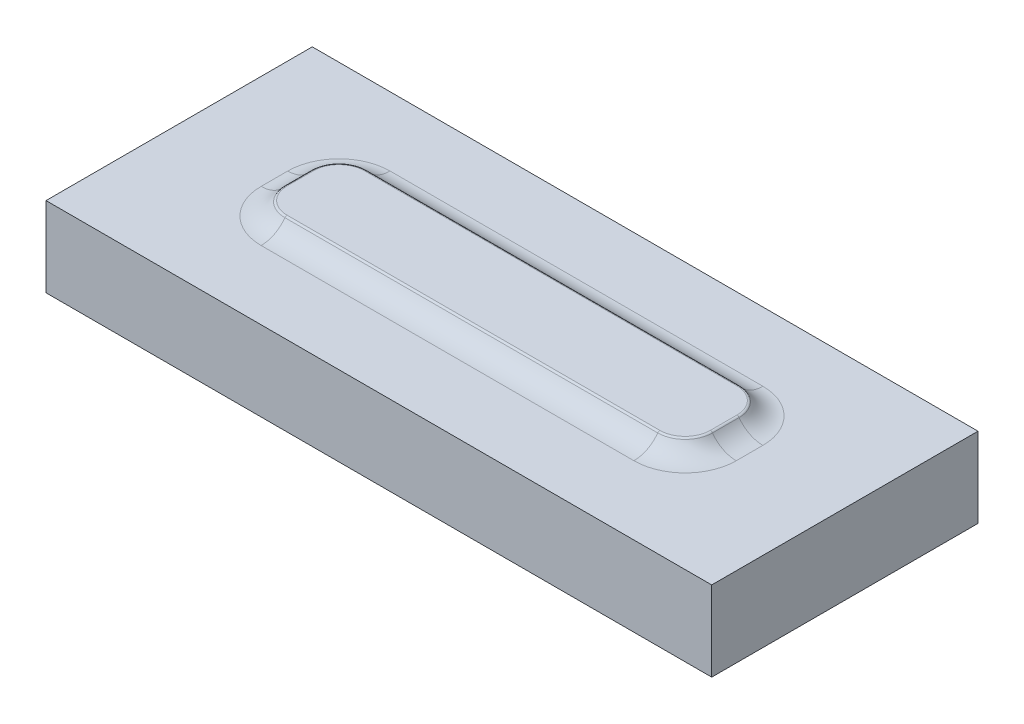
ISO-10303-21;
HEADER;
FILE_DESCRIPTION(('STEP AP214'),'2;1');
FILE_NAME('part.step','',(''),(''),'','','');
FILE_SCHEMA(('AUTOMOTIVE_DESIGN { 1 0 10303 214 1 1 1 1 }'));
ENDSEC;
DATA;
#1=APPLICATION_CONTEXT('core data for automotive mechanical design processes');
#2=APPLICATION_PROTOCOL_DEFINITION('international standard','automotive_design',2000,#1);
#3=PRODUCT_CONTEXT('',#1,'mechanical');
#4=PRODUCT('Part','Part','',(#3));
#5=PRODUCT_RELATED_PRODUCT_CATEGORY('part','',(#4));
#6=PRODUCT_DEFINITION_FORMATION('','',#4);
#7=PRODUCT_DEFINITION_CONTEXT('part definition',#1,'design');
#8=PRODUCT_DEFINITION('design','',#6,#7);
#9=PRODUCT_DEFINITION_SHAPE('','',#8);
#10=(LENGTH_UNIT() NAMED_UNIT(*) SI_UNIT(.MILLI.,.METRE.));
#11=(NAMED_UNIT(*) PLANE_ANGLE_UNIT() SI_UNIT($,.RADIAN.));
#12=(NAMED_UNIT(*) SI_UNIT($,.STERADIAN.) SOLID_ANGLE_UNIT());
#13=UNCERTAINTY_MEASURE_WITH_UNIT(LENGTH_MEASURE(1.E-05),#10,'distance_accuracy_value','');
#14=(GEOMETRIC_REPRESENTATION_CONTEXT(3) GLOBAL_UNCERTAINTY_ASSIGNED_CONTEXT((#13)) GLOBAL_UNIT_ASSIGNED_CONTEXT((#10,
#11,#12)) REPRESENTATION_CONTEXT('',''));
#15=CARTESIAN_POINT('',(0.,0.,0.));
#16=DIRECTION('',(0.,0.,1.));
#17=DIRECTION('',(1.,0.,0.));
#18=AXIS2_PLACEMENT_3D('',#15,#16,#17);
#19=CARTESIAN_POINT('',(0.,3.,0.));
#20=DIRECTION('',(0.,-1.,0.));
#21=DIRECTION('',(0.,0.,-1.));
#22=AXIS2_PLACEMENT_3D('',#19,#20,#21);
#23=PLANE('',#22);
#24=DIRECTION('',(1.,0.,0.));
#25=VECTOR('',#24,1.);
#26=CARTESIAN_POINT('',(0.,3.,2.42195444572929));
#27=LINE('',#26,#25);
#28=CARTESIAN_POINT('',(6.99999999999999,3.,2.42195444572929));
#29=VERTEX_POINT('',#28);
#30=CARTESIAN_POINT('',(-6.99999999999999,3.,2.42195444572929));
#31=VERTEX_POINT('',#30);
#32=EDGE_CURVE('E178',#29,#31,#27,.F.);
#33=ORIENTED_EDGE('',*,*,#32,.T.);
#34=CARTESIAN_POINT('',(-7.,3.,0.500000000000001));
#35=DIRECTION('',(0.,-1.,0.));
#36=DIRECTION('',(0.,0.,-1.));
#37=AXIS2_PLACEMENT_3D('',#34,#35,#36);
#38=CIRCLE('',#37,1.92195444572929);
#39=CARTESIAN_POINT('',(-8.92195444572929,3.,0.499999999999994));
#40=VERTEX_POINT('',#39);
#41=EDGE_CURVE('E200',#31,#40,#38,.T.);
#42=ORIENTED_EDGE('',*,*,#41,.T.);
#43=DIRECTION('',(0.,0.,1.));
#44=VECTOR('',#43,1.);
#45=CARTESIAN_POINT('',(-8.92195444572929,3.,0.));
#46=LINE('',#45,#44);
#47=CARTESIAN_POINT('',(-8.92195444572929,3.,-0.499999999999985));
#48=VERTEX_POINT('',#47);
#49=EDGE_CURVE('E197',#40,#48,#46,.F.);
#50=ORIENTED_EDGE('',*,*,#49,.T.);
#51=CARTESIAN_POINT('',(-7.,3.,-0.499999999999999));
#52=DIRECTION('',(0.,-1.,0.));
#53=DIRECTION('',(0.,0.,-1.));
#54=AXIS2_PLACEMENT_3D('',#51,#52,#53);
#55=CIRCLE('',#54,1.92195444572929);
#56=CARTESIAN_POINT('',(-6.99999999999999,3.,-2.42195444572929));
#57=VERTEX_POINT('',#56);
#58=EDGE_CURVE('E194',#48,#57,#55,.T.);
#59=ORIENTED_EDGE('',*,*,#58,.T.);
#60=DIRECTION('',(-1.,0.,0.));
#61=VECTOR('',#60,1.);
#62=CARTESIAN_POINT('',(0.,3.,-2.42195444572929));
#63=LINE('',#62,#61);
#64=CARTESIAN_POINT('',(6.99999999999999,3.,-2.42195444572929));
#65=VERTEX_POINT('',#64);
#66=EDGE_CURVE('E191',#57,#65,#63,.F.);
#67=ORIENTED_EDGE('',*,*,#66,.T.);
#68=CARTESIAN_POINT('',(7.,3.,-0.500000000000001));
#69=DIRECTION('',(0.,-1.,0.));
#70=DIRECTION('',(0.,0.,-1.));
#71=AXIS2_PLACEMENT_3D('',#68,#69,#70);
#72=CIRCLE('',#71,1.92195444572929);
#73=CARTESIAN_POINT('',(8.92195444572929,3.,-0.499999999999994));
#74=VERTEX_POINT('',#73);
#75=EDGE_CURVE('E189',#65,#74,#72,.T.);
#76=ORIENTED_EDGE('',*,*,#75,.T.);
#77=DIRECTION('',(0.,0.,-1.));
#78=VECTOR('',#77,1.);
#79=CARTESIAN_POINT('',(8.92195444572929,3.,0.));
#80=LINE('',#79,#78);
#81=CARTESIAN_POINT('',(8.92195444572929,3.,0.499999999999986));
#82=VERTEX_POINT('',#81);
#83=EDGE_CURVE('E187',#74,#82,#80,.F.);
#84=ORIENTED_EDGE('',*,*,#83,.T.);
#85=CARTESIAN_POINT('',(7.,3.,0.499999999999999));
#86=DIRECTION('',(0.,-1.,0.));
#87=DIRECTION('',(0.,0.,-1.));
#88=AXIS2_PLACEMENT_3D('',#85,#86,#87);
#89=CIRCLE('',#88,1.92195444572929);
#90=EDGE_CURVE('E180',#82,#29,#89,.T.);
#91=ORIENTED_EDGE('',*,*,#90,.T.);
#92=EDGE_LOOP('',(#33,#42,#50,#59,#67,#76,#84,#91));
#93=FACE_BOUND('',#92,.T.);
#94=DIRECTION('',(0.,0.,1.));
#95=VECTOR('',#94,1.);
#96=CARTESIAN_POINT('',(-12.5,3.,-5.));
#97=LINE('',#96,#95);
#98=CARTESIAN_POINT('',(-12.5,3.,-5.));
#99=VERTEX_POINT('',#98);
#100=CARTESIAN_POINT('',(-12.5,3.,5.));
#101=VERTEX_POINT('',#100);
#102=EDGE_CURVE('E165',#99,#101,#97,.T.);
#103=ORIENTED_EDGE('',*,*,#102,.T.);
#104=DIRECTION('',(1.,0.,0.));
#105=VECTOR('',#104,1.);
#106=CARTESIAN_POINT('',(12.5,3.,5.));
#107=LINE('',#106,#105);
#108=CARTESIAN_POINT('',(12.5,3.,5.));
#109=VERTEX_POINT('',#108);
#110=EDGE_CURVE('E154',#101,#109,#107,.T.);
#111=ORIENTED_EDGE('',*,*,#110,.T.);
#112=DIRECTION('',(0.,0.,-1.));
#113=VECTOR('',#112,1.);
#114=CARTESIAN_POINT('',(12.5,3.,-5.));
#115=LINE('',#114,#113);
#116=CARTESIAN_POINT('',(12.5,3.,-5.));
#117=VERTEX_POINT('',#116);
#118=EDGE_CURVE('E164',#109,#117,#115,.T.);
#119=ORIENTED_EDGE('',*,*,#118,.T.);
#120=DIRECTION('',(-1.,0.,0.));
#121=VECTOR('',#120,1.);
#122=CARTESIAN_POINT('',(12.5,3.,-5.));
#123=LINE('',#122,#121);
#124=EDGE_CURVE('E169',#117,#99,#123,.T.);
#125=ORIENTED_EDGE('',*,*,#124,.T.);
#126=EDGE_LOOP('',(#103,#111,#119,#125));
#127=FACE_BOUND('',#126,.T.);
#128=ADVANCED_FACE('F38',(#93,#127),#23,.F.);
#129=CARTESIAN_POINT('',(-12.5,3.,-5.));
#130=DIRECTION('',(1.,0.,0.));
#131=DIRECTION('',(0.,0.,-1.));
#132=AXIS2_PLACEMENT_3D('',#129,#130,#131);
#133=PLANE('',#132);
#134=DIRECTION('',(0.,0.,1.));
#135=VECTOR('',#134,1.);
#136=CARTESIAN_POINT('',(-12.5,0.,-5.));
#137=LINE('',#136,#135);
#138=CARTESIAN_POINT('',(-12.5,0.,-5.));
#139=VERTEX_POINT('',#138);
#140=CARTESIAN_POINT('',(-12.5,0.,5.));
#141=VERTEX_POINT('',#140);
#142=EDGE_CURVE('E177',#139,#141,#137,.T.);
#143=ORIENTED_EDGE('',*,*,#142,.T.);
#144=DIRECTION('',(0.,-1.,0.));
#145=VECTOR('',#144,1.);
#146=CARTESIAN_POINT('',(-12.5,3.,5.));
#147=LINE('',#146,#145);
#148=EDGE_CURVE('E158',#101,#141,#147,.T.);
#149=ORIENTED_EDGE('',*,*,#148,.F.);
#150=ORIENTED_EDGE('',*,*,#102,.F.);
#151=DIRECTION('',(0.,-1.,0.));
#152=VECTOR('',#151,1.);
#153=CARTESIAN_POINT('',(-12.5,3.,-5.));
#154=LINE('',#153,#152);
#155=EDGE_CURVE('E577',#99,#139,#154,.T.);
#156=ORIENTED_EDGE('',*,*,#155,.T.);
#157=EDGE_LOOP('',(#143,#149,#150,#156));
#158=FACE_BOUND('',#157,.T.);
#159=ADVANCED_FACE('F175',(#158),#133,.F.);
#160=CARTESIAN_POINT('',(12.5,3.,5.));
#161=DIRECTION('',(0.,0.,-1.));
#162=DIRECTION('',(-1.,0.,0.));
#163=AXIS2_PLACEMENT_3D('',#160,#161,#162);
#164=PLANE('',#163);
#165=DIRECTION('',(1.,0.,0.));
#166=VECTOR('',#165,1.);
#167=CARTESIAN_POINT('',(12.5,0.,5.));
#168=LINE('',#167,#166);
#169=CARTESIAN_POINT('',(12.5,0.,5.));
#170=VERTEX_POINT('',#169);
#171=EDGE_CURVE('E575',#141,#170,#168,.T.);
#172=ORIENTED_EDGE('',*,*,#171,.T.);
#173=DIRECTION('',(0.,-1.,0.));
#174=VECTOR('',#173,1.);
#175=CARTESIAN_POINT('',(12.5,3.,5.));
#176=LINE('',#175,#174);
#177=EDGE_CURVE('E161',#109,#170,#176,.T.);
#178=ORIENTED_EDGE('',*,*,#177,.F.);
#179=ORIENTED_EDGE('',*,*,#110,.F.);
#180=ORIENTED_EDGE('',*,*,#148,.T.);
#181=EDGE_LOOP('',(#172,#178,#179,#180));
#182=FACE_BOUND('',#181,.T.);
#183=ADVANCED_FACE('F156',(#182),#164,.F.);
#184=CARTESIAN_POINT('',(12.5,3.,-5.));
#185=DIRECTION('',(-1.,0.,0.));
#186=DIRECTION('',(0.,0.,1.));
#187=AXIS2_PLACEMENT_3D('',#184,#185,#186);
#188=PLANE('',#187);
#189=DIRECTION('',(0.,0.,-1.));
#190=VECTOR('',#189,1.);
#191=CARTESIAN_POINT('',(12.5,0.,-5.));
#192=LINE('',#191,#190);
#193=CARTESIAN_POINT('',(12.5,0.,-5.));
#194=VERTEX_POINT('',#193);
#195=EDGE_CURVE('E572',#170,#194,#192,.T.);
#196=ORIENTED_EDGE('',*,*,#195,.T.);
#197=DIRECTION('',(0.,-1.,0.));
#198=VECTOR('',#197,1.);
#199=CARTESIAN_POINT('',(12.5,3.,-5.));
#200=LINE('',#199,#198);
#201=EDGE_CURVE('E182',#117,#194,#200,.T.);
#202=ORIENTED_EDGE('',*,*,#201,.F.);
#203=ORIENTED_EDGE('',*,*,#118,.F.);
#204=ORIENTED_EDGE('',*,*,#177,.T.);
#205=EDGE_LOOP('',(#196,#202,#203,#204));
#206=FACE_BOUND('',#205,.T.);
#207=ADVANCED_FACE('F354',(#206),#188,.F.);
#208=CARTESIAN_POINT('',(12.5,3.,-5.));
#209=DIRECTION('',(0.,0.,1.));
#210=DIRECTION('',(1.,0.,0.));
#211=AXIS2_PLACEMENT_3D('',#208,#209,#210);
#212=PLANE('',#211);
#213=DIRECTION('',(-1.,0.,0.));
#214=VECTOR('',#213,1.);
#215=CARTESIAN_POINT('',(12.5,0.,-5.));
#216=LINE('',#215,#214);
#217=EDGE_CURVE('E173',#194,#139,#216,.T.);
#218=ORIENTED_EDGE('',*,*,#217,.T.);
#219=ORIENTED_EDGE('',*,*,#155,.F.);
#220=ORIENTED_EDGE('',*,*,#124,.F.);
#221=ORIENTED_EDGE('',*,*,#201,.T.);
#222=EDGE_LOOP('',(#218,#219,#220,#221));
#223=FACE_BOUND('',#222,.T.);
#224=ADVANCED_FACE('F350',(#223),#212,.F.);
#225=CARTESIAN_POINT('',(0.,0.,0.));
#226=DIRECTION('',(0.,-1.,0.));
#227=DIRECTION('',(0.,0.,-1.));
#228=AXIS2_PLACEMENT_3D('',#225,#226,#227);
#229=PLANE('',#228);
#230=ORIENTED_EDGE('',*,*,#142,.F.);
#231=ORIENTED_EDGE('',*,*,#217,.F.);
#232=ORIENTED_EDGE('',*,*,#195,.F.);
#233=ORIENTED_EDGE('',*,*,#171,.F.);
#234=EDGE_LOOP('',(#230,#231,#232,#233));
#235=FACE_BOUND('',#234,.T.);
#236=ADVANCED_FACE('F347',(#235),#229,.T.);
#237=CARTESIAN_POINT('',(-7.,3.5,0.500000000000001));
#238=DIRECTION('',(0.,1.,0.));
#239=DIRECTION('',(0.,0.,1.));
#240=AXIS2_PLACEMENT_3D('',#237,#238,#239);
#241=PLANE('',#240);
#242=DIRECTION('',(0.,0.,-1.));
#243=VECTOR('',#242,1.);
#244=CARTESIAN_POINT('',(-7.94727501124839,3.5,0.499999999999994));
#245=LINE('',#244,#243);
#246=CARTESIAN_POINT('',(-7.94727501124839,3.5,-0.499999999999991));
#247=VERTEX_POINT('',#246);
#248=CARTESIAN_POINT('',(-7.94727501124839,3.5,0.499999999999995));
#249=VERTEX_POINT('',#248);
#250=EDGE_CURVE('E232',#247,#249,#245,.F.);
#251=ORIENTED_EDGE('',*,*,#250,.T.);
#252=CARTESIAN_POINT('',(-7.,3.5,0.500000000000001));
#253=DIRECTION('',(0.,1.,0.));
#254=DIRECTION('',(0.,0.,1.));
#255=AXIS2_PLACEMENT_3D('',#252,#253,#254);
#256=CIRCLE('',#255,0.947275011248392);
#257=CARTESIAN_POINT('',(-6.99999999999999,3.5,1.44727501124839));
#258=VERTEX_POINT('',#257);
#259=EDGE_CURVE('E234',#249,#258,#256,.T.);
#260=ORIENTED_EDGE('',*,*,#259,.T.);
#261=DIRECTION('',(-1.,0.,0.));
#262=VECTOR('',#261,1.);
#263=CARTESIAN_POINT('',(6.99999999999999,3.5,1.44727501124839));
#264=LINE('',#263,#262);
#265=CARTESIAN_POINT('',(6.99999999999999,3.5,1.44727501124839));
#266=VERTEX_POINT('',#265);
#267=EDGE_CURVE('E203',#258,#266,#264,.F.);
#268=ORIENTED_EDGE('',*,*,#267,.T.);
#269=CARTESIAN_POINT('',(7.,3.5,0.499999999999999));
#270=DIRECTION('',(0.,1.,0.));
#271=DIRECTION('',(0.,0.,1.));
#272=AXIS2_PLACEMENT_3D('',#269,#270,#271);
#273=CIRCLE('',#272,0.947275011248392);
#274=CARTESIAN_POINT('',(7.94727501124839,3.5,0.499999999999992));
#275=VERTEX_POINT('',#274);
#276=EDGE_CURVE('E222',#266,#275,#273,.T.);
#277=ORIENTED_EDGE('',*,*,#276,.T.);
#278=DIRECTION('',(0.,0.,1.));
#279=VECTOR('',#278,1.);
#280=CARTESIAN_POINT('',(7.94727501124839,3.5,-0.499999999999994));
#281=LINE('',#280,#279);
#282=CARTESIAN_POINT('',(7.94727501124839,3.5,-0.499999999999994));
#283=VERTEX_POINT('',#282);
#284=EDGE_CURVE('E224',#275,#283,#281,.F.);
#285=ORIENTED_EDGE('',*,*,#284,.T.);
#286=CARTESIAN_POINT('',(7.,3.5,-0.500000000000001));
#287=DIRECTION('',(0.,1.,0.));
#288=DIRECTION('',(0.,0.,1.));
#289=AXIS2_PLACEMENT_3D('',#286,#287,#288);
#290=CIRCLE('',#289,0.947275011248392);
#291=CARTESIAN_POINT('',(6.99999999999999,3.5,-1.44727501124839));
#292=VERTEX_POINT('',#291);
#293=EDGE_CURVE('E226',#283,#292,#290,.T.);
#294=ORIENTED_EDGE('',*,*,#293,.T.);
#295=DIRECTION('',(1.,0.,0.));
#296=VECTOR('',#295,1.);
#297=CARTESIAN_POINT('',(-6.99999999999999,3.5,-1.44727501124839));
#298=LINE('',#297,#296);
#299=CARTESIAN_POINT('',(-6.99999999999999,3.5,-1.44727501124839));
#300=VERTEX_POINT('',#299);
#301=EDGE_CURVE('E228',#292,#300,#298,.F.);
#302=ORIENTED_EDGE('',*,*,#301,.T.);
#303=CARTESIAN_POINT('',(-7.,3.5,-0.499999999999999));
#304=DIRECTION('',(0.,1.,0.));
#305=DIRECTION('',(0.,0.,1.));
#306=AXIS2_PLACEMENT_3D('',#303,#304,#305);
#307=CIRCLE('',#306,0.947275011248392);
#308=EDGE_CURVE('E230',#300,#247,#307,.T.);
#309=ORIENTED_EDGE('',*,*,#308,.T.);
#310=EDGE_LOOP('',(#251,#260,#268,#277,#285,#294,#302,#309));
#311=FACE_BOUND('',#310,.T.);
#312=ADVANCED_FACE('F309',(#311),#241,.T.);
#313=CARTESIAN_POINT('',(7.,4.1,-0.500000000000001));
#314=DIRECTION('',(0.,-1.,0.));
#315=DIRECTION('',(0.,0.,-1.));
#316=AXIS2_PLACEMENT_3D('',#313,#314,#315);
#317=TOROIDAL_SURFACE('',#316,1.92195444572929,1.1);
#318=CARTESIAN_POINT('',(6.99999999999999,4.1,-2.42195444573013));
#319=DIRECTION('',(1.,0.,0.));
#320=DIRECTION('',(0.,0.,-1.));
#321=AXIS2_PLACEMENT_3D('',#318,#319,#320);
#322=CIRCLE('',#321,1.1);
#323=CARTESIAN_POINT('',(6.99999999999999,3.45833333333373,-1.52849829745569));
#324=VERTEX_POINT('',#323);
#325=EDGE_CURVE('E219',#324,#65,#322,.T.);
#326=ORIENTED_EDGE('',*,*,#325,.F.);
#327=CARTESIAN_POINT('',(7.,3.45833333333333,-0.500000000000001));
#328=DIRECTION('',(0.,1.,0.));
#329=DIRECTION('',(0.,0.,1.));
#330=AXIS2_PLACEMENT_3D('',#327,#328,#329);
#331=CIRCLE('',#330,1.02849829745513);
#332=CARTESIAN_POINT('',(8.02849829745513,3.45833333333333,-0.499999999999993));
#333=VERTEX_POINT('',#332);
#334=EDGE_CURVE('E246',#324,#333,#331,.F.);
#335=ORIENTED_EDGE('',*,*,#334,.T.);
#336=CARTESIAN_POINT('',(8.92195444572929,4.1,-0.499999999999987));
#337=DIRECTION('',(0.,0.,-1.));
#338=DIRECTION('',(-1.,0.,0.));
#339=AXIS2_PLACEMENT_3D('',#336,#337,#338);
#340=CIRCLE('',#339,1.1);
#341=EDGE_CURVE('E217',#74,#333,#340,.T.);
#342=ORIENTED_EDGE('',*,*,#341,.F.);
#343=ORIENTED_EDGE('',*,*,#75,.F.);
#344=EDGE_LOOP('',(#326,#335,#342,#343));
#345=FACE_BOUND('',#344,.T.);
#346=ADVANCED_FACE('F283',(#345),#317,.F.);
#347=CARTESIAN_POINT('',(6.99999999999999,4.1,-2.42195444572929));
#348=DIRECTION('',(-1.,0.,0.));
#349=DIRECTION('',(0.,0.,1.));
#350=AXIS2_PLACEMENT_3D('',#347,#348,#349);
#351=CYLINDRICAL_SURFACE('',#350,1.1);
#352=CARTESIAN_POINT('',(-6.99999999999999,4.1,-2.42195444573012));
#353=DIRECTION('',(1.,0.,0.));
#354=DIRECTION('',(0.,0.,-1.));
#355=AXIS2_PLACEMENT_3D('',#352,#353,#354);
#356=CIRCLE('',#355,1.1);
#357=CARTESIAN_POINT('',(-6.99999999999999,3.45833333333373,-1.52849829745568));
#358=VERTEX_POINT('',#357);
#359=EDGE_CURVE('E215',#358,#57,#356,.T.);
#360=ORIENTED_EDGE('',*,*,#359,.F.);
#361=DIRECTION('',(-1.,0.,0.));
#362=VECTOR('',#361,1.);
#363=CARTESIAN_POINT('',(6.99999999999999,3.45833333333333,-1.52849829745513));
#364=LINE('',#363,#362);
#365=EDGE_CURVE('E244',#358,#324,#364,.F.);
#366=ORIENTED_EDGE('',*,*,#365,.T.);
#367=ORIENTED_EDGE('',*,*,#325,.T.);
#368=ORIENTED_EDGE('',*,*,#66,.F.);
#369=EDGE_LOOP('',(#360,#366,#367,#368));
#370=FACE_BOUND('',#369,.T.);
#371=ADVANCED_FACE('F293',(#370),#351,.F.);
#372=CARTESIAN_POINT('',(8.92195444572929,4.1,-0.499999999999994));
#373=DIRECTION('',(0.,0.,-1.));
#374=DIRECTION('',(-1.,0.,0.));
#375=AXIS2_PLACEMENT_3D('',#372,#373,#374);
#376=CYLINDRICAL_SURFACE('',#375,1.1);
#377=ORIENTED_EDGE('',*,*,#341,.T.);
#378=DIRECTION('',(0.,0.,-1.));
#379=VECTOR('',#378,1.);
#380=CARTESIAN_POINT('',(8.02849829745513,3.45833333333333,-0.499999999999994));
#381=LINE('',#380,#379);
#382=CARTESIAN_POINT('',(8.02849829745513,3.45833333333333,0.499999999999992));
#383=VERTEX_POINT('',#382);
#384=EDGE_CURVE('E62',#333,#383,#381,.F.);
#385=ORIENTED_EDGE('',*,*,#384,.T.);
#386=CARTESIAN_POINT('',(8.92195444572929,4.1,0.499999999999992));
#387=DIRECTION('',(0.,0.,-1.));
#388=DIRECTION('',(-1.,0.,0.));
#389=AXIS2_PLACEMENT_3D('',#386,#387,#388);
#390=CIRCLE('',#389,1.1);
#391=EDGE_CURVE('E213',#82,#383,#390,.T.);
#392=ORIENTED_EDGE('',*,*,#391,.F.);
#393=ORIENTED_EDGE('',*,*,#83,.F.);
#394=EDGE_LOOP('',(#377,#385,#392,#393));
#395=FACE_BOUND('',#394,.T.);
#396=ADVANCED_FACE('F286',(#395),#376,.F.);
#397=CARTESIAN_POINT('',(-7.,4.1,-0.499999999999999));
#398=DIRECTION('',(0.,-1.,0.));
#399=DIRECTION('',(0.,0.,-1.));
#400=AXIS2_PLACEMENT_3D('',#397,#398,#399);
#401=TOROIDAL_SURFACE('',#400,1.92195444572929,1.1);
#402=CARTESIAN_POINT('',(-8.92195444573013,4.1,-0.499999999999985));
#403=DIRECTION('',(0.,0.,-1.));
#404=DIRECTION('',(-1.,0.,0.));
#405=AXIS2_PLACEMENT_3D('',#402,#403,#404);
#406=CIRCLE('',#405,1.1);
#407=CARTESIAN_POINT('',(-8.02849829745569,3.45833333333373,-0.499999999999991));
#408=VERTEX_POINT('',#407);
#409=EDGE_CURVE('E211',#408,#48,#406,.T.);
#410=ORIENTED_EDGE('',*,*,#409,.F.);
#411=CARTESIAN_POINT('',(-7.,3.45833333333333,-0.499999999999999));
#412=DIRECTION('',(0.,1.,0.));
#413=DIRECTION('',(0.,0.,1.));
#414=AXIS2_PLACEMENT_3D('',#411,#412,#413);
#415=CIRCLE('',#414,1.02849829745513);
#416=EDGE_CURVE('E242',#408,#358,#415,.F.);
#417=ORIENTED_EDGE('',*,*,#416,.T.);
#418=ORIENTED_EDGE('',*,*,#359,.T.);
#419=ORIENTED_EDGE('',*,*,#58,.F.);
#420=EDGE_LOOP('',(#410,#417,#418,#419));
#421=FACE_BOUND('',#420,.T.);
#422=ADVANCED_FACE('F296',(#421),#401,.F.);
#423=CARTESIAN_POINT('',(7.,4.1,0.499999999999999));
#424=DIRECTION('',(0.,-1.,0.));
#425=DIRECTION('',(0.,0.,-1.));
#426=AXIS2_PLACEMENT_3D('',#423,#424,#425);
#427=TOROIDAL_SURFACE('',#426,1.92195444572929,1.1);
#428=ORIENTED_EDGE('',*,*,#391,.T.);
#429=CARTESIAN_POINT('',(7.,3.45833333333333,0.499999999999999));
#430=DIRECTION('',(0.,1.,0.));
#431=DIRECTION('',(0.,0.,1.));
#432=AXIS2_PLACEMENT_3D('',#429,#430,#431);
#433=CIRCLE('',#432,1.02849829745513);
#434=CARTESIAN_POINT('',(6.99999999999999,3.45833333333333,1.52849829745513));
#435=VERTEX_POINT('',#434);
#436=EDGE_CURVE('E47',#383,#435,#433,.F.);
#437=ORIENTED_EDGE('',*,*,#436,.T.);
#438=CARTESIAN_POINT('',(6.99999999999999,4.1,2.42195444572929));
#439=DIRECTION('',(1.,0.,0.));
#440=DIRECTION('',(0.,0.,-1.));
#441=AXIS2_PLACEMENT_3D('',#438,#439,#440);
#442=CIRCLE('',#441,1.1);
#443=EDGE_CURVE('E209',#29,#435,#442,.T.);
#444=ORIENTED_EDGE('',*,*,#443,.F.);
#445=ORIENTED_EDGE('',*,*,#90,.F.);
#446=EDGE_LOOP('',(#428,#437,#444,#445));
#447=FACE_BOUND('',#446,.T.);
#448=ADVANCED_FACE('F368',(#447),#427,.F.);
#449=CARTESIAN_POINT('',(-8.92195444572929,4.1,-0.499999999999992));
#450=DIRECTION('',(0.,0.,1.));
#451=DIRECTION('',(1.,0.,0.));
#452=AXIS2_PLACEMENT_3D('',#449,#450,#451);
#453=CYLINDRICAL_SURFACE('',#452,1.1);
#454=CARTESIAN_POINT('',(-8.92195444573013,4.1,0.499999999999994));
#455=DIRECTION('',(0.,0.,-1.));
#456=DIRECTION('',(-1.,0.,0.));
#457=AXIS2_PLACEMENT_3D('',#454,#455,#456);
#458=CIRCLE('',#457,1.1);
#459=CARTESIAN_POINT('',(-8.02849829745569,3.45833333333373,0.499999999999994));
#460=VERTEX_POINT('',#459);
#461=EDGE_CURVE('E207',#460,#40,#458,.T.);
#462=ORIENTED_EDGE('',*,*,#461,.F.);
#463=DIRECTION('',(0.,0.,1.));
#464=VECTOR('',#463,1.);
#465=CARTESIAN_POINT('',(-8.02849829745513,3.45833333333333,-0.499999999999992));
#466=LINE('',#465,#464);
#467=EDGE_CURVE('E240',#460,#408,#466,.F.);
#468=ORIENTED_EDGE('',*,*,#467,.T.);
#469=ORIENTED_EDGE('',*,*,#409,.T.);
#470=ORIENTED_EDGE('',*,*,#49,.F.);
#471=EDGE_LOOP('',(#462,#468,#469,#470));
#472=FACE_BOUND('',#471,.T.);
#473=ADVANCED_FACE('F365',(#472),#453,.F.);
#474=CARTESIAN_POINT('',(6.99999999999999,4.1,2.42195444572929));
#475=DIRECTION('',(1.,0.,0.));
#476=DIRECTION('',(0.,0.,-1.));
#477=AXIS2_PLACEMENT_3D('',#474,#475,#476);
#478=CYLINDRICAL_SURFACE('',#477,1.1);
#479=ORIENTED_EDGE('',*,*,#443,.T.);
#480=DIRECTION('',(1.,0.,0.));
#481=VECTOR('',#480,1.);
#482=CARTESIAN_POINT('',(6.99999999999999,3.45833333333333,1.52849829745513));
#483=LINE('',#482,#481);
#484=CARTESIAN_POINT('',(-6.99999999999999,3.45833333333333,1.52849829745513));
#485=VERTEX_POINT('',#484);
#486=EDGE_CURVE('E12',#435,#485,#483,.F.);
#487=ORIENTED_EDGE('',*,*,#486,.T.);
#488=CARTESIAN_POINT('',(-6.99999999999999,4.1,2.42195444572929));
#489=DIRECTION('',(1.,0.,0.));
#490=DIRECTION('',(0.,0.,-1.));
#491=AXIS2_PLACEMENT_3D('',#488,#489,#490);
#492=CIRCLE('',#491,1.1);
#493=EDGE_CURVE('E204',#31,#485,#492,.T.);
#494=ORIENTED_EDGE('',*,*,#493,.F.);
#495=ORIENTED_EDGE('',*,*,#32,.F.);
#496=EDGE_LOOP('',(#479,#487,#494,#495));
#497=FACE_BOUND('',#496,.T.);
#498=ADVANCED_FACE('F323',(#497),#478,.F.);
#499=CARTESIAN_POINT('',(-7.,4.1,0.500000000000001));
#500=DIRECTION('',(0.,-1.,0.));
#501=DIRECTION('',(0.,0.,-1.));
#502=AXIS2_PLACEMENT_3D('',#499,#500,#501);
#503=TOROIDAL_SURFACE('',#502,1.92195444572929,1.1);
#504=ORIENTED_EDGE('',*,*,#493,.T.);
#505=CARTESIAN_POINT('',(-7.,3.45833333333333,0.500000000000001));
#506=DIRECTION('',(0.,1.,0.));
#507=DIRECTION('',(0.,0.,1.));
#508=AXIS2_PLACEMENT_3D('',#505,#506,#507);
#509=CIRCLE('',#508,1.02849829745513);
#510=EDGE_CURVE('E237',#485,#460,#509,.F.);
#511=ORIENTED_EDGE('',*,*,#510,.T.);
#512=ORIENTED_EDGE('',*,*,#461,.T.);
#513=ORIENTED_EDGE('',*,*,#41,.F.);
#514=EDGE_LOOP('',(#504,#511,#512,#513));
#515=FACE_BOUND('',#514,.T.);
#516=ADVANCED_FACE('F328',(#515),#503,.F.);
#517=CARTESIAN_POINT('',(7.,3.4,-0.500000000000001));
#518=DIRECTION('',(0.,-1.,0.));
#519=DIRECTION('',(0.,0.,-1.));
#520=AXIS2_PLACEMENT_3D('',#517,#518,#519);
#521=TOROIDAL_SURFACE('',#520,0.947275011248392,0.1);
#522=CARTESIAN_POINT('',(7.94727501124839,3.4,-0.499999999999994));
#523=DIRECTION('',(0.,0.,1.));
#524=DIRECTION('',(1.,0.,0.));
#525=AXIS2_PLACEMENT_3D('',#522,#523,#524);
#526=CIRCLE('',#525,0.1);
#527=EDGE_CURVE('E265',#333,#283,#526,.T.);
#528=ORIENTED_EDGE('',*,*,#527,.F.);
#529=ORIENTED_EDGE('',*,*,#334,.F.);
#530=CARTESIAN_POINT('',(6.99999999999999,3.4,-1.44727501124839));
#531=DIRECTION('',(-1.,0.,0.));
#532=DIRECTION('',(0.,0.,1.));
#533=AXIS2_PLACEMENT_3D('',#530,#531,#532);
#534=CIRCLE('',#533,0.1);
#535=EDGE_CURVE('E42',#292,#324,#534,.T.);
#536=ORIENTED_EDGE('',*,*,#535,.F.);
#537=ORIENTED_EDGE('',*,*,#293,.F.);
#538=EDGE_LOOP('',(#528,#529,#536,#537));
#539=FACE_BOUND('',#538,.T.);
#540=ADVANCED_FACE('F40',(#539),#521,.T.);
#541=CARTESIAN_POINT('',(6.99999999999999,3.4,-1.44727501124839));
#542=DIRECTION('',(-1.,0.,0.));
#543=DIRECTION('',(0.,0.,1.));
#544=AXIS2_PLACEMENT_3D('',#541,#542,#543);
#545=CYLINDRICAL_SURFACE('',#544,0.1);
#546=ORIENTED_EDGE('',*,*,#535,.T.);
#547=ORIENTED_EDGE('',*,*,#365,.F.);
#548=CARTESIAN_POINT('',(-6.99999999999999,3.4,-1.44727501124839));
#549=DIRECTION('',(-1.,0.,0.));
#550=DIRECTION('',(0.,0.,1.));
#551=AXIS2_PLACEMENT_3D('',#548,#549,#550);
#552=CIRCLE('',#551,0.1);
#553=EDGE_CURVE('E263',#300,#358,#552,.T.);
#554=ORIENTED_EDGE('',*,*,#553,.F.);
#555=ORIENTED_EDGE('',*,*,#301,.F.);
#556=EDGE_LOOP('',(#546,#547,#554,#555));
#557=FACE_BOUND('',#556,.T.);
#558=ADVANCED_FACE('F275',(#557),#545,.T.);
#559=CARTESIAN_POINT('',(7.94727501124839,3.4,-0.499999999999994));
#560=DIRECTION('',(0.,0.,-1.));
#561=DIRECTION('',(-1.,0.,0.));
#562=AXIS2_PLACEMENT_3D('',#559,#560,#561);
#563=CYLINDRICAL_SURFACE('',#562,0.1);
#564=ORIENTED_EDGE('',*,*,#527,.T.);
#565=ORIENTED_EDGE('',*,*,#284,.F.);
#566=CARTESIAN_POINT('',(7.94727501124839,3.4,0.499999999999992));
#567=DIRECTION('',(0.,0.,1.));
#568=DIRECTION('',(1.,0.,0.));
#569=AXIS2_PLACEMENT_3D('',#566,#567,#568);
#570=CIRCLE('',#569,0.1);
#571=EDGE_CURVE('E260',#383,#275,#570,.T.);
#572=ORIENTED_EDGE('',*,*,#571,.F.);
#573=ORIENTED_EDGE('',*,*,#384,.F.);
#574=EDGE_LOOP('',(#564,#565,#572,#573));
#575=FACE_BOUND('',#574,.T.);
#576=ADVANCED_FACE('F312',(#575),#563,.T.);
#577=CARTESIAN_POINT('',(-7.,3.4,-0.499999999999999));
#578=DIRECTION('',(0.,-1.,0.));
#579=DIRECTION('',(0.,0.,-1.));
#580=AXIS2_PLACEMENT_3D('',#577,#578,#579);
#581=TOROIDAL_SURFACE('',#580,0.947275011248392,0.1);
#582=ORIENTED_EDGE('',*,*,#553,.T.);
#583=ORIENTED_EDGE('',*,*,#416,.F.);
#584=CARTESIAN_POINT('',(-7.94727501124839,3.4,-0.499999999999991));
#585=DIRECTION('',(0.,0.,1.));
#586=DIRECTION('',(1.,0.,0.));
#587=AXIS2_PLACEMENT_3D('',#584,#585,#586);
#588=CIRCLE('',#587,0.1);
#589=EDGE_CURVE('E257',#247,#408,#588,.T.);
#590=ORIENTED_EDGE('',*,*,#589,.F.);
#591=ORIENTED_EDGE('',*,*,#308,.F.);
#592=EDGE_LOOP('',(#582,#583,#590,#591));
#593=FACE_BOUND('',#592,.T.);
#594=ADVANCED_FACE('F300',(#593),#581,.T.);
#595=CARTESIAN_POINT('',(7.,3.4,0.499999999999999));
#596=DIRECTION('',(0.,-1.,0.));
#597=DIRECTION('',(0.,0.,-1.));
#598=AXIS2_PLACEMENT_3D('',#595,#596,#597);
#599=TOROIDAL_SURFACE('',#598,0.947275011248392,0.1);
#600=ORIENTED_EDGE('',*,*,#571,.T.);
#601=ORIENTED_EDGE('',*,*,#276,.F.);
#602=CARTESIAN_POINT('',(6.99999999999999,3.4,1.44727501124839));
#603=DIRECTION('',(-1.,0.,0.));
#604=DIRECTION('',(0.,0.,1.));
#605=AXIS2_PLACEMENT_3D('',#602,#603,#604);
#606=CIRCLE('',#605,0.1);
#607=EDGE_CURVE('E254',#435,#266,#606,.T.);
#608=ORIENTED_EDGE('',*,*,#607,.F.);
#609=ORIENTED_EDGE('',*,*,#436,.F.);
#610=EDGE_LOOP('',(#600,#601,#608,#609));
#611=FACE_BOUND('',#610,.T.);
#612=ADVANCED_FACE('F314',(#611),#599,.T.);
#613=CARTESIAN_POINT('',(-7.94727501124839,3.4,-0.499999999999992));
#614=DIRECTION('',(0.,0.,1.));
#615=DIRECTION('',(1.,0.,0.));
#616=AXIS2_PLACEMENT_3D('',#613,#614,#615);
#617=CYLINDRICAL_SURFACE('',#616,0.1);
#618=ORIENTED_EDGE('',*,*,#589,.T.);
#619=ORIENTED_EDGE('',*,*,#467,.F.);
#620=CARTESIAN_POINT('',(-7.94727501124839,3.4,0.499999999999995));
#621=DIRECTION('',(0.,0.,1.));
#622=DIRECTION('',(1.,0.,0.));
#623=AXIS2_PLACEMENT_3D('',#620,#621,#622);
#624=CIRCLE('',#623,0.1);
#625=EDGE_CURVE('E252',#249,#460,#624,.T.);
#626=ORIENTED_EDGE('',*,*,#625,.F.);
#627=ORIENTED_EDGE('',*,*,#250,.F.);
#628=EDGE_LOOP('',(#618,#619,#626,#627));
#629=FACE_BOUND('',#628,.T.);
#630=ADVANCED_FACE('F305',(#629),#617,.T.);
#631=CARTESIAN_POINT('',(6.99999999999999,3.4,1.44727501124839));
#632=DIRECTION('',(1.,0.,0.));
#633=DIRECTION('',(0.,0.,-1.));
#634=AXIS2_PLACEMENT_3D('',#631,#632,#633);
#635=CYLINDRICAL_SURFACE('',#634,0.1);
#636=ORIENTED_EDGE('',*,*,#607,.T.);
#637=ORIENTED_EDGE('',*,*,#267,.F.);
#638=CARTESIAN_POINT('',(-6.99999999999999,3.4,1.44727501124839));
#639=DIRECTION('',(-1.,0.,0.));
#640=DIRECTION('',(0.,-1.,0.));
#641=AXIS2_PLACEMENT_3D('',#638,#639,#640);
#642=CIRCLE('',#641,0.1);
#643=EDGE_CURVE('E250',#485,#258,#642,.T.);
#644=ORIENTED_EDGE('',*,*,#643,.F.);
#645=ORIENTED_EDGE('',*,*,#486,.F.);
#646=EDGE_LOOP('',(#636,#637,#644,#645));
#647=FACE_BOUND('',#646,.T.);
#648=ADVANCED_FACE('F320',(#647),#635,.T.);
#649=CARTESIAN_POINT('',(-7.,3.4,0.500000000000001));
#650=DIRECTION('',(0.,-1.,0.));
#651=DIRECTION('',(0.,0.,-1.));
#652=AXIS2_PLACEMENT_3D('',#649,#650,#651);
#653=TOROIDAL_SURFACE('',#652,0.947275011248392,0.1);
#654=ORIENTED_EDGE('',*,*,#625,.T.);
#655=ORIENTED_EDGE('',*,*,#510,.F.);
#656=ORIENTED_EDGE('',*,*,#643,.T.);
#657=ORIENTED_EDGE('',*,*,#259,.F.);
#658=EDGE_LOOP('',(#654,#655,#656,#657));
#659=FACE_BOUND('',#658,.T.);
#660=ADVANCED_FACE('F331',(#659),#653,.T.);
#661=CLOSED_SHELL('',(#128,#159,#183,#207,#224,#236,#312,#346,#371,#396,#422,#448,#473,#498,
#516,#540,#558,#576,#594,#612,#630,#648,#660));
#662=MANIFOLD_SOLID_BREP('B2',#661);
#663=ADVANCED_BREP_SHAPE_REPRESENTATION('',(#18,#662),#14);
#664=SHAPE_DEFINITION_REPRESENTATION(#9,#663);
ENDSEC;
END-ISO-10303-21;
